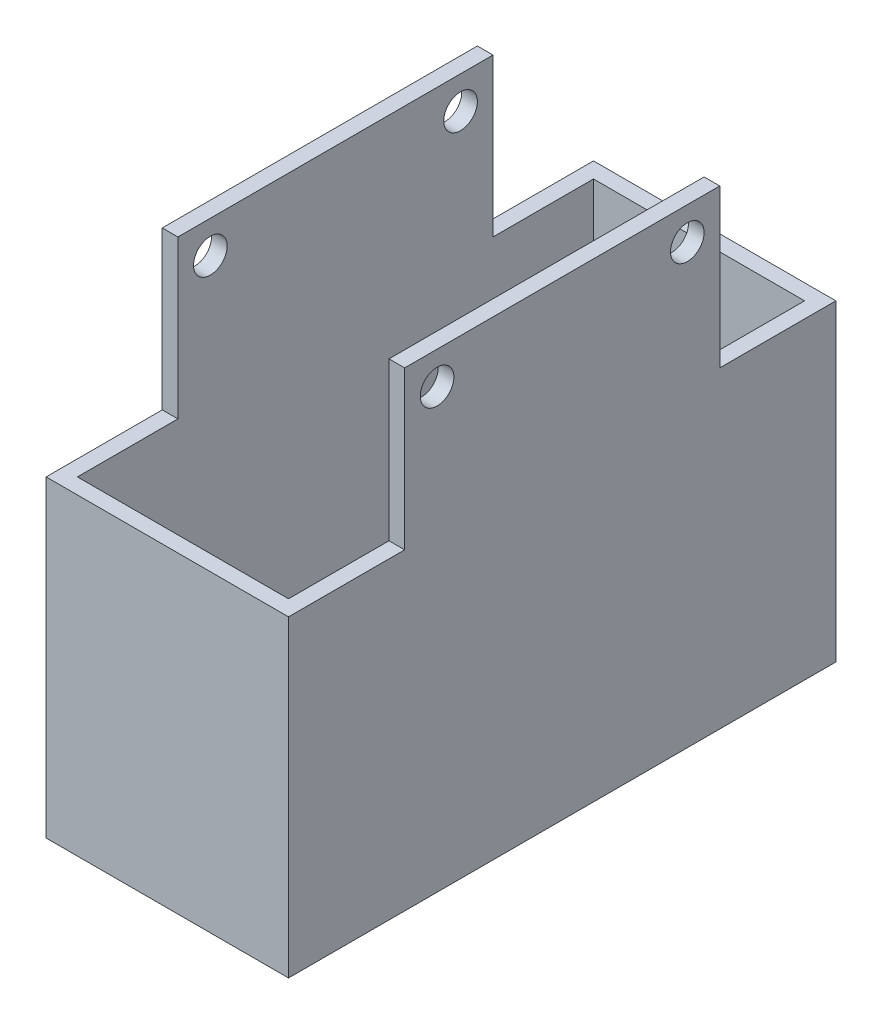
ISO-10303-21;
HEADER;
FILE_DESCRIPTION(('STEP AP214'),'2;1');
FILE_NAME('part.step','',(''),(''),'','','');
FILE_SCHEMA(('AUTOMOTIVE_DESIGN { 1 0 10303 214 1 1 1 1 }'));
ENDSEC;
DATA;
#1=APPLICATION_CONTEXT('core data for automotive mechanical design processes');
#2=APPLICATION_PROTOCOL_DEFINITION('international standard','automotive_design',2000,#1);
#3=PRODUCT_CONTEXT('',#1,'mechanical');
#4=PRODUCT('Part','Part','',(#3));
#5=PRODUCT_RELATED_PRODUCT_CATEGORY('part','',(#4));
#6=PRODUCT_DEFINITION_FORMATION('','',#4);
#7=PRODUCT_DEFINITION_CONTEXT('part definition',#1,'design');
#8=PRODUCT_DEFINITION('design','',#6,#7);
#9=PRODUCT_DEFINITION_SHAPE('','',#8);
#10=(LENGTH_UNIT() NAMED_UNIT(*) SI_UNIT(.MILLI.,.METRE.));
#11=(NAMED_UNIT(*) PLANE_ANGLE_UNIT() SI_UNIT($,.RADIAN.));
#12=(NAMED_UNIT(*) SI_UNIT($,.STERADIAN.) SOLID_ANGLE_UNIT());
#13=UNCERTAINTY_MEASURE_WITH_UNIT(LENGTH_MEASURE(1.E-05),#10,'distance_accuracy_value','');
#14=(GEOMETRIC_REPRESENTATION_CONTEXT(3) GLOBAL_UNCERTAINTY_ASSIGNED_CONTEXT((#13)) GLOBAL_UNIT_ASSIGNED_CONTEXT((#10,
#11,#12)) REPRESENTATION_CONTEXT('',''));
#15=CARTESIAN_POINT('',(0.,0.,0.));
#16=DIRECTION('',(0.,0.,1.));
#17=DIRECTION('',(1.,0.,0.));
#18=AXIS2_PLACEMENT_3D('',#15,#16,#17);
#19=CARTESIAN_POINT('',(-13.5,40.,33.));
#20=DIRECTION('',(1.,0.,0.));
#21=DIRECTION('',(0.,0.,-1.));
#22=AXIS2_PLACEMENT_3D('',#19,#20,#21);
#23=PLANE('',#22);
#24=CARTESIAN_POINT('',(-13.5,56.,-16.));
#25=DIRECTION('',(-1.,0.,0.));
#26=DIRECTION('',(0.,0.,1.));
#27=AXIS2_PLACEMENT_3D('',#24,#25,#26);
#28=CIRCLE('',#27,2.15);
#29=CARTESIAN_POINT('',(-13.5,56.,-13.85));
#30=VERTEX_POINT('',#29);
#31=EDGE_CURVE('E301',#30,#30,#28,.F.);
#32=ORIENTED_EDGE('',*,*,#31,.F.);
#33=EDGE_LOOP('',(#32));
#34=FACE_BOUND('',#33,.T.);
#35=CARTESIAN_POINT('',(-13.5,56.,16.));
#36=DIRECTION('',(-1.,0.,0.));
#37=DIRECTION('',(0.,0.,1.));
#38=AXIS2_PLACEMENT_3D('',#35,#36,#37);
#39=CIRCLE('',#38,2.15);
#40=CARTESIAN_POINT('',(-13.5,56.,18.15));
#41=VERTEX_POINT('',#40);
#42=EDGE_CURVE('E282',#41,#41,#39,.F.);
#43=ORIENTED_EDGE('',*,*,#42,.F.);
#44=EDGE_LOOP('',(#43));
#45=FACE_BOUND('',#44,.T.);
#46=DIRECTION('',(0.,-1.,0.));
#47=VECTOR('',#46,1.);
#48=CARTESIAN_POINT('',(-13.5,40.,33.));
#49=LINE('',#48,#47);
#50=CARTESIAN_POINT('',(-13.5,40.,33.));
#51=VERTEX_POINT('',#50);
#52=CARTESIAN_POINT('',(-13.5,3.,33.));
#53=VERTEX_POINT('',#52);
#54=EDGE_CURVE('E160',#51,#53,#49,.T.);
#55=ORIENTED_EDGE('',*,*,#54,.T.);
#56=DIRECTION('',(0.,0.,-1.));
#57=VECTOR('',#56,1.);
#58=CARTESIAN_POINT('',(-13.5,3.,33.));
#59=LINE('',#58,#57);
#60=CARTESIAN_POINT('',(-13.5,3.,-33.));
#61=VERTEX_POINT('',#60);
#62=EDGE_CURVE('E147',#53,#61,#59,.T.);
#63=ORIENTED_EDGE('',*,*,#62,.T.);
#64=DIRECTION('',(0.,-1.,0.));
#65=VECTOR('',#64,1.);
#66=CARTESIAN_POINT('',(-13.5,40.,-33.));
#67=LINE('',#66,#65);
#68=CARTESIAN_POINT('',(-13.5,40.,-33.));
#69=VERTEX_POINT('',#68);
#70=EDGE_CURVE('E157',#69,#61,#67,.T.);
#71=ORIENTED_EDGE('',*,*,#70,.F.);
#72=DIRECTION('',(0.,0.,1.));
#73=VECTOR('',#72,1.);
#74=CARTESIAN_POINT('',(-13.5,40.,33.));
#75=LINE('',#74,#73);
#76=CARTESIAN_POINT('',(-13.5,40.,-20.15));
#77=VERTEX_POINT('',#76);
#78=EDGE_CURVE('E226',#69,#77,#75,.T.);
#79=ORIENTED_EDGE('',*,*,#78,.T.);
#80=DIRECTION('',(0.,1.,0.));
#81=VECTOR('',#80,1.);
#82=CARTESIAN_POINT('',(-13.5,20.15,-20.15));
#83=LINE('',#82,#81);
#84=CARTESIAN_POINT('',(-13.5,60.15,-20.15));
#85=VERTEX_POINT('',#84);
#86=EDGE_CURVE('E250',#77,#85,#83,.T.);
#87=ORIENTED_EDGE('',*,*,#86,.T.);
#88=DIRECTION('',(0.,0.,1.));
#89=VECTOR('',#88,1.);
#90=CARTESIAN_POINT('',(-13.5,60.15,-20.15));
#91=LINE('',#90,#89);
#92=CARTESIAN_POINT('',(-13.5,60.15,20.15));
#93=VERTEX_POINT('',#92);
#94=EDGE_CURVE('E161',#85,#93,#91,.T.);
#95=ORIENTED_EDGE('',*,*,#94,.T.);
#96=DIRECTION('',(0.,1.,0.));
#97=VECTOR('',#96,1.);
#98=CARTESIAN_POINT('',(-13.5,20.15,20.15));
#99=LINE('',#98,#97);
#100=CARTESIAN_POINT('',(-13.5,40.,20.15));
#101=VERTEX_POINT('',#100);
#102=EDGE_CURVE('E309',#101,#93,#99,.T.);
#103=ORIENTED_EDGE('',*,*,#102,.F.);
#104=EDGE_CURVE('E224',#101,#51,#75,.T.);
#105=ORIENTED_EDGE('',*,*,#104,.T.);
#106=EDGE_LOOP('',(#55,#63,#71,#79,#87,#95,#103,#105));
#107=FACE_BOUND('',#106,.T.);
#108=ADVANCED_FACE('F36',(#34,#45,#107),#23,.T.);
#109=CARTESIAN_POINT('',(13.5,40.,33.));
#110=DIRECTION('',(0.,0.,-1.));
#111=DIRECTION('',(-1.,0.,0.));
#112=AXIS2_PLACEMENT_3D('',#109,#110,#111);
#113=PLANE('',#112);
#114=DIRECTION('',(0.,-1.,0.));
#115=VECTOR('',#114,1.);
#116=CARTESIAN_POINT('',(13.5,40.,33.));
#117=LINE('',#116,#115);
#118=CARTESIAN_POINT('',(13.5,40.,33.));
#119=VERTEX_POINT('',#118);
#120=CARTESIAN_POINT('',(13.5,3.,33.));
#121=VERTEX_POINT('',#120);
#122=EDGE_CURVE('E169',#119,#121,#117,.T.);
#123=ORIENTED_EDGE('',*,*,#122,.T.);
#124=DIRECTION('',(-1.,0.,0.));
#125=VECTOR('',#124,1.);
#126=CARTESIAN_POINT('',(13.5,3.,33.));
#127=LINE('',#126,#125);
#128=EDGE_CURVE('E162',#121,#53,#127,.T.);
#129=ORIENTED_EDGE('',*,*,#128,.T.);
#130=ORIENTED_EDGE('',*,*,#54,.F.);
#131=DIRECTION('',(1.,0.,0.));
#132=VECTOR('',#131,1.);
#133=CARTESIAN_POINT('',(13.5,40.,33.));
#134=LINE('',#133,#132);
#135=EDGE_CURVE('E242',#51,#119,#134,.T.);
#136=ORIENTED_EDGE('',*,*,#135,.T.);
#137=EDGE_LOOP('',(#123,#129,#130,#136));
#138=FACE_BOUND('',#137,.T.);
#139=ADVANCED_FACE('F316',(#138),#113,.T.);
#140=CARTESIAN_POINT('',(13.5,40.,33.));
#141=DIRECTION('',(-1.,0.,0.));
#142=DIRECTION('',(0.,0.,1.));
#143=AXIS2_PLACEMENT_3D('',#140,#141,#142);
#144=PLANE('',#143);
#145=CARTESIAN_POINT('',(13.5,56.,-16.));
#146=DIRECTION('',(1.,0.,0.));
#147=DIRECTION('',(0.,0.,-1.));
#148=AXIS2_PLACEMENT_3D('',#145,#146,#147);
#149=CIRCLE('',#148,2.15);
#150=CARTESIAN_POINT('',(13.5,56.,-18.15));
#151=VERTEX_POINT('',#150);
#152=EDGE_CURVE('E253',#151,#151,#149,.F.);
#153=ORIENTED_EDGE('',*,*,#152,.F.);
#154=EDGE_LOOP('',(#153));
#155=FACE_BOUND('',#154,.T.);
#156=CARTESIAN_POINT('',(13.5,56.,16.));
#157=DIRECTION('',(1.,0.,0.));
#158=DIRECTION('',(0.,0.,-1.));
#159=AXIS2_PLACEMENT_3D('',#156,#157,#158);
#160=CIRCLE('',#159,2.15);
#161=CARTESIAN_POINT('',(13.5,56.,13.85));
#162=VERTEX_POINT('',#161);
#163=EDGE_CURVE('E304',#162,#162,#160,.F.);
#164=ORIENTED_EDGE('',*,*,#163,.F.);
#165=EDGE_LOOP('',(#164));
#166=FACE_BOUND('',#165,.T.);
#167=DIRECTION('',(0.,-1.,0.));
#168=VECTOR('',#167,1.);
#169=CARTESIAN_POINT('',(13.5,40.,-33.));
#170=LINE('',#169,#168);
#171=CARTESIAN_POINT('',(13.5,40.,-33.));
#172=VERTEX_POINT('',#171);
#173=CARTESIAN_POINT('',(13.5,3.,-33.));
#174=VERTEX_POINT('',#173);
#175=EDGE_CURVE('E167',#172,#174,#170,.T.);
#176=ORIENTED_EDGE('',*,*,#175,.T.);
#177=DIRECTION('',(0.,0.,1.));
#178=VECTOR('',#177,1.);
#179=CARTESIAN_POINT('',(13.5,3.,33.));
#180=LINE('',#179,#178);
#181=EDGE_CURVE('E51',#174,#121,#180,.T.);
#182=ORIENTED_EDGE('',*,*,#181,.T.);
#183=ORIENTED_EDGE('',*,*,#122,.F.);
#184=DIRECTION('',(0.,0.,-1.));
#185=VECTOR('',#184,1.);
#186=CARTESIAN_POINT('',(13.5,40.,33.));
#187=LINE('',#186,#185);
#188=CARTESIAN_POINT('',(13.5,40.,20.15));
#189=VERTEX_POINT('',#188);
#190=EDGE_CURVE('E171',#119,#189,#187,.T.);
#191=ORIENTED_EDGE('',*,*,#190,.T.);
#192=DIRECTION('',(0.,1.,0.));
#193=VECTOR('',#192,1.);
#194=CARTESIAN_POINT('',(13.5,20.15,20.15));
#195=LINE('',#194,#193);
#196=CARTESIAN_POINT('',(13.5,60.15,20.15));
#197=VERTEX_POINT('',#196);
#198=EDGE_CURVE('E58',#189,#197,#195,.T.);
#199=ORIENTED_EDGE('',*,*,#198,.T.);
#200=DIRECTION('',(0.,0.,-1.));
#201=VECTOR('',#200,1.);
#202=CARTESIAN_POINT('',(13.5,60.15,-20.15));
#203=LINE('',#202,#201);
#204=CARTESIAN_POINT('',(13.5,60.15,-20.15));
#205=VERTEX_POINT('',#204);
#206=EDGE_CURVE('E261',#197,#205,#203,.T.);
#207=ORIENTED_EDGE('',*,*,#206,.T.);
#208=DIRECTION('',(0.,1.,0.));
#209=VECTOR('',#208,1.);
#210=CARTESIAN_POINT('',(13.5,20.15,-20.15));
#211=LINE('',#210,#209);
#212=CARTESIAN_POINT('',(13.5,40.,-20.15));
#213=VERTEX_POINT('',#212);
#214=EDGE_CURVE('E248',#213,#205,#211,.T.);
#215=ORIENTED_EDGE('',*,*,#214,.F.);
#216=EDGE_CURVE('E243',#213,#172,#187,.T.);
#217=ORIENTED_EDGE('',*,*,#216,.T.);
#218=EDGE_LOOP('',(#176,#182,#183,#191,#199,#207,#215,#217));
#219=FACE_BOUND('',#218,.T.);
#220=ADVANCED_FACE('F246',(#155,#166,#219),#144,.T.);
#221=CARTESIAN_POINT('',(13.5,40.,-33.));
#222=DIRECTION('',(0.,0.,1.));
#223=DIRECTION('',(1.,0.,0.));
#224=AXIS2_PLACEMENT_3D('',#221,#222,#223);
#225=PLANE('',#224);
#226=ORIENTED_EDGE('',*,*,#70,.T.);
#227=DIRECTION('',(1.,0.,0.));
#228=VECTOR('',#227,1.);
#229=CARTESIAN_POINT('',(13.5,3.,-33.));
#230=LINE('',#229,#228);
#231=EDGE_CURVE('E11',#61,#174,#230,.T.);
#232=ORIENTED_EDGE('',*,*,#231,.T.);
#233=ORIENTED_EDGE('',*,*,#175,.F.);
#234=DIRECTION('',(-1.,0.,0.));
#235=VECTOR('',#234,1.);
#236=CARTESIAN_POINT('',(13.5,40.,-33.));
#237=LINE('',#236,#235);
#238=EDGE_CURVE('E166',#172,#69,#237,.T.);
#239=ORIENTED_EDGE('',*,*,#238,.T.);
#240=EDGE_LOOP('',(#226,#232,#233,#239));
#241=FACE_BOUND('',#240,.T.);
#242=ADVANCED_FACE('F164',(#241),#225,.T.);
#243=CARTESIAN_POINT('',(-15.5,0.,-20.15));
#244=DIRECTION('',(0.,0.,1.));
#245=DIRECTION('',(1.,0.,0.));
#246=AXIS2_PLACEMENT_3D('',#243,#244,#245);
#247=PLANE('',#246);
#248=DIRECTION('',(1.,0.,0.));
#249=VECTOR('',#248,1.);
#250=CARTESIAN_POINT('',(-15.5,60.15,-20.15));
#251=LINE('',#250,#249);
#252=CARTESIAN_POINT('',(-15.5,60.15,-20.15));
#253=VERTEX_POINT('',#252);
#254=EDGE_CURVE('E238',#253,#85,#251,.T.);
#255=ORIENTED_EDGE('',*,*,#254,.T.);
#256=ORIENTED_EDGE('',*,*,#86,.F.);
#257=DIRECTION('',(1.,0.,0.));
#258=VECTOR('',#257,1.);
#259=CARTESIAN_POINT('',(-15.5,40.,-20.15));
#260=LINE('',#259,#258);
#261=CARTESIAN_POINT('',(-15.5,40.,-20.15));
#262=VERTEX_POINT('',#261);
#263=EDGE_CURVE('E215',#262,#77,#260,.T.);
#264=ORIENTED_EDGE('',*,*,#263,.F.);
#265=DIRECTION('',(0.,-1.,0.));
#266=VECTOR('',#265,1.);
#267=CARTESIAN_POINT('',(-15.5,0.,-20.15));
#268=LINE('',#267,#266);
#269=EDGE_CURVE('E264',#253,#262,#268,.T.);
#270=ORIENTED_EDGE('',*,*,#269,.F.);
#271=EDGE_LOOP('',(#255,#256,#264,#270));
#272=FACE_BOUND('',#271,.T.);
#273=ADVANCED_FACE('F263',(#272),#247,.F.);
#274=CARTESIAN_POINT('',(-15.5,0.,20.15));
#275=DIRECTION('',(0.,0.,-1.));
#276=DIRECTION('',(-1.,0.,0.));
#277=AXIS2_PLACEMENT_3D('',#274,#275,#276);
#278=PLANE('',#277);
#279=DIRECTION('',(1.,0.,0.));
#280=VECTOR('',#279,1.);
#281=CARTESIAN_POINT('',(-15.5,40.,20.15));
#282=LINE('',#281,#280);
#283=CARTESIAN_POINT('',(-15.5,40.,20.15));
#284=VERTEX_POINT('',#283);
#285=EDGE_CURVE('E221',#284,#101,#282,.T.);
#286=ORIENTED_EDGE('',*,*,#285,.T.);
#287=ORIENTED_EDGE('',*,*,#102,.T.);
#288=DIRECTION('',(1.,0.,0.));
#289=VECTOR('',#288,1.);
#290=CARTESIAN_POINT('',(-15.5,60.15,20.15));
#291=LINE('',#290,#289);
#292=CARTESIAN_POINT('',(-15.5,60.15,20.15));
#293=VERTEX_POINT('',#292);
#294=EDGE_CURVE('E229',#293,#93,#291,.T.);
#295=ORIENTED_EDGE('',*,*,#294,.F.);
#296=DIRECTION('',(0.,1.,0.));
#297=VECTOR('',#296,1.);
#298=CARTESIAN_POINT('',(-15.5,0.,20.15));
#299=LINE('',#298,#297);
#300=EDGE_CURVE('E270',#284,#293,#299,.T.);
#301=ORIENTED_EDGE('',*,*,#300,.F.);
#302=EDGE_LOOP('',(#286,#287,#295,#301));
#303=FACE_BOUND('',#302,.T.);
#304=ADVANCED_FACE('F341',(#303),#278,.F.);
#305=CARTESIAN_POINT('',(-15.5,56.,16.));
#306=DIRECTION('',(1.,0.,0.));
#307=DIRECTION('',(0.,0.,-1.));
#308=AXIS2_PLACEMENT_3D('',#305,#306,#307);
#309=CYLINDRICAL_SURFACE('',#308,2.15);
#310=ORIENTED_EDGE('',*,*,#42,.T.);
#311=EDGE_LOOP('',(#310));
#312=FACE_BOUND('',#311,.T.);
#313=CARTESIAN_POINT('',(-15.5,56.,16.));
#314=DIRECTION('',(1.,0.,0.));
#315=DIRECTION('',(0.,0.,-1.));
#316=AXIS2_PLACEMENT_3D('',#313,#314,#315);
#317=CIRCLE('',#316,2.15);
#318=CARTESIAN_POINT('',(-15.5,56.,13.85));
#319=VERTEX_POINT('',#318);
#320=EDGE_CURVE('E268',#319,#319,#317,.T.);
#321=ORIENTED_EDGE('',*,*,#320,.F.);
#322=EDGE_LOOP('',(#321));
#323=FACE_BOUND('',#322,.T.);
#324=ADVANCED_FACE('F380',(#312,#323),#309,.F.);
#325=CARTESIAN_POINT('',(-15.5,56.,-16.));
#326=DIRECTION('',(1.,0.,0.));
#327=DIRECTION('',(0.,0.,-1.));
#328=AXIS2_PLACEMENT_3D('',#325,#326,#327);
#329=CYLINDRICAL_SURFACE('',#328,2.15);
#330=ORIENTED_EDGE('',*,*,#31,.T.);
#331=EDGE_LOOP('',(#330));
#332=FACE_BOUND('',#331,.T.);
#333=CARTESIAN_POINT('',(-15.5,56.,-16.));
#334=DIRECTION('',(1.,0.,0.));
#335=DIRECTION('',(0.,0.,-1.));
#336=AXIS2_PLACEMENT_3D('',#333,#334,#335);
#337=CIRCLE('',#336,2.15);
#338=CARTESIAN_POINT('',(-15.5,56.,-18.15));
#339=VERTEX_POINT('',#338);
#340=EDGE_CURVE('E273',#339,#339,#337,.T.);
#341=ORIENTED_EDGE('',*,*,#340,.F.);
#342=EDGE_LOOP('',(#341));
#343=FACE_BOUND('',#342,.T.);
#344=ADVANCED_FACE('F384',(#332,#343),#329,.F.);
#345=CARTESIAN_POINT('',(-15.5,60.15,0.));
#346=DIRECTION('',(0.,-1.,0.));
#347=DIRECTION('',(0.,0.,-1.));
#348=AXIS2_PLACEMENT_3D('',#345,#346,#347);
#349=PLANE('',#348);
#350=ORIENTED_EDGE('',*,*,#294,.T.);
#351=ORIENTED_EDGE('',*,*,#94,.F.);
#352=ORIENTED_EDGE('',*,*,#254,.F.);
#353=DIRECTION('',(0.,0.,-1.));
#354=VECTOR('',#353,1.);
#355=CARTESIAN_POINT('',(-15.5,60.15,0.));
#356=LINE('',#355,#354);
#357=EDGE_CURVE('E267',#293,#253,#356,.T.);
#358=ORIENTED_EDGE('',*,*,#357,.F.);
#359=EDGE_LOOP('',(#350,#351,#352,#358));
#360=FACE_BOUND('',#359,.T.);
#361=ADVANCED_FACE('F257',(#360),#349,.F.);
#362=CARTESIAN_POINT('',(0.,40.,0.));
#363=DIRECTION('',(0.,1.,0.));
#364=DIRECTION('',(0.,0.,1.));
#365=AXIS2_PLACEMENT_3D('',#362,#363,#364);
#366=PLANE('',#365);
#367=DIRECTION('',(0.,0.,1.));
#368=VECTOR('',#367,1.);
#369=CARTESIAN_POINT('',(-15.5,40.,35.));
#370=LINE('',#369,#368);
#371=CARTESIAN_POINT('',(-15.5,40.,-35.));
#372=VERTEX_POINT('',#371);
#373=EDGE_CURVE('E179',#372,#262,#370,.T.);
#374=ORIENTED_EDGE('',*,*,#373,.T.);
#375=ORIENTED_EDGE('',*,*,#263,.T.);
#376=ORIENTED_EDGE('',*,*,#78,.F.);
#377=ORIENTED_EDGE('',*,*,#238,.F.);
#378=ORIENTED_EDGE('',*,*,#216,.F.);
#379=CARTESIAN_POINT('',(15.5,40.,-20.15));
#380=VERTEX_POINT('',#379);
#381=EDGE_CURVE('E208',#213,#380,#260,.T.);
#382=ORIENTED_EDGE('',*,*,#381,.T.);
#383=DIRECTION('',(0.,0.,-1.));
#384=VECTOR('',#383,1.);
#385=CARTESIAN_POINT('',(15.5,40.,35.));
#386=LINE('',#385,#384);
#387=CARTESIAN_POINT('',(15.5,40.,-35.));
#388=VERTEX_POINT('',#387);
#389=EDGE_CURVE('E185',#380,#388,#386,.T.);
#390=ORIENTED_EDGE('',*,*,#389,.T.);
#391=DIRECTION('',(-1.,0.,0.));
#392=VECTOR('',#391,1.);
#393=CARTESIAN_POINT('',(15.5,40.,-35.));
#394=LINE('',#393,#392);
#395=EDGE_CURVE('E189',#388,#372,#394,.T.);
#396=ORIENTED_EDGE('',*,*,#395,.T.);
#397=EDGE_LOOP('',(#374,#375,#376,#377,#378,#382,#390,#396));
#398=FACE_BOUND('',#397,.T.);
#399=ADVANCED_FACE('F249',(#398),#366,.T.);
#400=ORIENTED_EDGE('',*,*,#285,.F.);
#401=CARTESIAN_POINT('',(-15.5,40.,35.));
#402=VERTEX_POINT('',#401);
#403=EDGE_CURVE('E183',#284,#402,#370,.T.);
#404=ORIENTED_EDGE('',*,*,#403,.T.);
#405=DIRECTION('',(1.,0.,0.));
#406=VECTOR('',#405,1.);
#407=CARTESIAN_POINT('',(15.5,40.,35.));
#408=LINE('',#407,#406);
#409=CARTESIAN_POINT('',(15.5,40.,35.));
#410=VERTEX_POINT('',#409);
#411=EDGE_CURVE('E182',#402,#410,#408,.T.);
#412=ORIENTED_EDGE('',*,*,#411,.T.);
#413=CARTESIAN_POINT('',(15.5,40.,20.15));
#414=VERTEX_POINT('',#413);
#415=EDGE_CURVE('E186',#410,#414,#386,.T.);
#416=ORIENTED_EDGE('',*,*,#415,.T.);
#417=EDGE_CURVE('E44',#189,#414,#282,.T.);
#418=ORIENTED_EDGE('',*,*,#417,.F.);
#419=ORIENTED_EDGE('',*,*,#190,.F.);
#420=ORIENTED_EDGE('',*,*,#135,.F.);
#421=ORIENTED_EDGE('',*,*,#104,.F.);
#422=EDGE_LOOP('',(#400,#404,#412,#416,#418,#419,#420,#421));
#423=FACE_BOUND('',#422,.T.);
#424=ADVANCED_FACE('F319',(#423),#366,.T.);
#425=CARTESIAN_POINT('',(0.,0.,0.));
#426=DIRECTION('',(0.,1.,0.));
#427=DIRECTION('',(0.,0.,1.));
#428=AXIS2_PLACEMENT_3D('',#425,#426,#427);
#429=PLANE('',#428);
#430=DIRECTION('',(0.,0.,1.));
#431=VECTOR('',#430,1.);
#432=CARTESIAN_POINT('',(-15.5,0.,35.));
#433=LINE('',#432,#431);
#434=CARTESIAN_POINT('',(-15.5,0.,-35.));
#435=VERTEX_POINT('',#434);
#436=CARTESIAN_POINT('',(-15.5,0.,35.));
#437=VERTEX_POINT('',#436);
#438=EDGE_CURVE('E178',#435,#437,#433,.T.);
#439=ORIENTED_EDGE('',*,*,#438,.F.);
#440=DIRECTION('',(-1.,0.,0.));
#441=VECTOR('',#440,1.);
#442=CARTESIAN_POINT('',(15.5,0.,-35.));
#443=LINE('',#442,#441);
#444=CARTESIAN_POINT('',(15.5,0.,-35.));
#445=VERTEX_POINT('',#444);
#446=EDGE_CURVE('E200',#445,#435,#443,.T.);
#447=ORIENTED_EDGE('',*,*,#446,.F.);
#448=DIRECTION('',(0.,0.,-1.));
#449=VECTOR('',#448,1.);
#450=CARTESIAN_POINT('',(15.5,0.,35.));
#451=LINE('',#450,#449);
#452=CARTESIAN_POINT('',(15.5,0.,35.));
#453=VERTEX_POINT('',#452);
#454=EDGE_CURVE('E197',#453,#445,#451,.T.);
#455=ORIENTED_EDGE('',*,*,#454,.F.);
#456=DIRECTION('',(1.,0.,0.));
#457=VECTOR('',#456,1.);
#458=CARTESIAN_POINT('',(15.5,0.,35.));
#459=LINE('',#458,#457);
#460=EDGE_CURVE('E194',#437,#453,#459,.T.);
#461=ORIENTED_EDGE('',*,*,#460,.F.);
#462=EDGE_LOOP('',(#439,#447,#455,#461));
#463=FACE_BOUND('',#462,.T.);
#464=ADVANCED_FACE('F360',(#463),#429,.F.);
#465=CARTESIAN_POINT('',(-15.5,40.,35.));
#466=DIRECTION('',(1.,0.,0.));
#467=DIRECTION('',(0.,0.,-1.));
#468=AXIS2_PLACEMENT_3D('',#465,#466,#467);
#469=PLANE('',#468);
#470=ORIENTED_EDGE('',*,*,#438,.T.);
#471=DIRECTION('',(0.,-1.,0.));
#472=VECTOR('',#471,1.);
#473=CARTESIAN_POINT('',(-15.5,40.,35.));
#474=LINE('',#473,#472);
#475=EDGE_CURVE('E207',#402,#437,#474,.T.);
#476=ORIENTED_EDGE('',*,*,#475,.F.);
#477=ORIENTED_EDGE('',*,*,#403,.F.);
#478=ORIENTED_EDGE('',*,*,#300,.T.);
#479=ORIENTED_EDGE('',*,*,#357,.T.);
#480=ORIENTED_EDGE('',*,*,#269,.T.);
#481=ORIENTED_EDGE('',*,*,#373,.F.);
#482=DIRECTION('',(0.,-1.,0.));
#483=VECTOR('',#482,1.);
#484=CARTESIAN_POINT('',(-15.5,40.,-35.));
#485=LINE('',#484,#483);
#486=EDGE_CURVE('E191',#372,#435,#485,.T.);
#487=ORIENTED_EDGE('',*,*,#486,.T.);
#488=EDGE_LOOP('',(#470,#476,#477,#478,#479,#480,#481,#487));
#489=FACE_BOUND('',#488,.T.);
#490=ORIENTED_EDGE('',*,*,#320,.T.);
#491=EDGE_LOOP('',(#490));
#492=FACE_BOUND('',#491,.T.);
#493=ORIENTED_EDGE('',*,*,#340,.T.);
#494=EDGE_LOOP('',(#493));
#495=FACE_BOUND('',#494,.T.);
#496=ADVANCED_FACE('F38',(#489,#492,#495),#469,.F.);
#497=CARTESIAN_POINT('',(15.5,40.,35.));
#498=DIRECTION('',(0.,0.,-1.));
#499=DIRECTION('',(-1.,0.,0.));
#500=AXIS2_PLACEMENT_3D('',#497,#498,#499);
#501=PLANE('',#500);
#502=ORIENTED_EDGE('',*,*,#460,.T.);
#503=DIRECTION('',(0.,-1.,0.));
#504=VECTOR('',#503,1.);
#505=CARTESIAN_POINT('',(15.5,40.,35.));
#506=LINE('',#505,#504);
#507=EDGE_CURVE('E206',#410,#453,#506,.T.);
#508=ORIENTED_EDGE('',*,*,#507,.F.);
#509=ORIENTED_EDGE('',*,*,#411,.F.);
#510=ORIENTED_EDGE('',*,*,#475,.T.);
#511=EDGE_LOOP('',(#502,#508,#509,#510));
#512=FACE_BOUND('',#511,.T.);
#513=ADVANCED_FACE('F365',(#512),#501,.F.);
#514=CARTESIAN_POINT('',(15.5,40.,35.));
#515=DIRECTION('',(-1.,0.,0.));
#516=DIRECTION('',(0.,0.,1.));
#517=AXIS2_PLACEMENT_3D('',#514,#515,#516);
#518=PLANE('',#517);
#519=ORIENTED_EDGE('',*,*,#454,.T.);
#520=DIRECTION('',(0.,-1.,0.));
#521=VECTOR('',#520,1.);
#522=CARTESIAN_POINT('',(15.5,40.,-35.));
#523=LINE('',#522,#521);
#524=EDGE_CURVE('E204',#388,#445,#523,.T.);
#525=ORIENTED_EDGE('',*,*,#524,.F.);
#526=ORIENTED_EDGE('',*,*,#389,.F.);
#527=DIRECTION('',(0.,-1.,0.));
#528=VECTOR('',#527,1.);
#529=CARTESIAN_POINT('',(15.5,0.,-20.15));
#530=LINE('',#529,#528);
#531=CARTESIAN_POINT('',(15.5,60.15,-20.15));
#532=VERTEX_POINT('',#531);
#533=EDGE_CURVE('E285',#532,#380,#530,.T.);
#534=ORIENTED_EDGE('',*,*,#533,.F.);
#535=DIRECTION('',(0.,0.,-1.));
#536=VECTOR('',#535,1.);
#537=CARTESIAN_POINT('',(15.5,60.15,0.));
#538=LINE('',#537,#536);
#539=CARTESIAN_POINT('',(15.5,60.15,20.15));
#540=VERTEX_POINT('',#539);
#541=EDGE_CURVE('E287',#540,#532,#538,.T.);
#542=ORIENTED_EDGE('',*,*,#541,.F.);
#543=DIRECTION('',(0.,1.,0.));
#544=VECTOR('',#543,1.);
#545=CARTESIAN_POINT('',(15.5,0.,20.15));
#546=LINE('',#545,#544);
#547=EDGE_CURVE('E289',#414,#540,#546,.T.);
#548=ORIENTED_EDGE('',*,*,#547,.F.);
#549=ORIENTED_EDGE('',*,*,#415,.F.);
#550=ORIENTED_EDGE('',*,*,#507,.T.);
#551=EDGE_LOOP('',(#519,#525,#526,#534,#542,#548,#549,#550));
#552=FACE_BOUND('',#551,.T.);
#553=CARTESIAN_POINT('',(15.5,56.,16.));
#554=DIRECTION('',(1.,0.,0.));
#555=DIRECTION('',(0.,0.,-1.));
#556=AXIS2_PLACEMENT_3D('',#553,#554,#555);
#557=CIRCLE('',#556,2.15);
#558=CARTESIAN_POINT('',(15.5,56.,13.85));
#559=VERTEX_POINT('',#558);
#560=EDGE_CURVE('E281',#559,#559,#557,.T.);
#561=ORIENTED_EDGE('',*,*,#560,.F.);
#562=EDGE_LOOP('',(#561));
#563=FACE_BOUND('',#562,.T.);
#564=CARTESIAN_POINT('',(15.5,56.,-16.));
#565=DIRECTION('',(1.,0.,0.));
#566=DIRECTION('',(0.,0.,-1.));
#567=AXIS2_PLACEMENT_3D('',#564,#565,#566);
#568=CIRCLE('',#567,2.15);
#569=CARTESIAN_POINT('',(15.5,56.,-18.15));
#570=VERTEX_POINT('',#569);
#571=EDGE_CURVE('E278',#570,#570,#568,.T.);
#572=ORIENTED_EDGE('',*,*,#571,.F.);
#573=EDGE_LOOP('',(#572));
#574=FACE_BOUND('',#573,.T.);
#575=ADVANCED_FACE('F324',(#552,#563,#574),#518,.F.);
#576=CARTESIAN_POINT('',(15.5,40.,-35.));
#577=DIRECTION('',(0.,0.,1.));
#578=DIRECTION('',(1.,0.,0.));
#579=AXIS2_PLACEMENT_3D('',#576,#577,#578);
#580=PLANE('',#579);
#581=ORIENTED_EDGE('',*,*,#446,.T.);
#582=ORIENTED_EDGE('',*,*,#486,.F.);
#583=ORIENTED_EDGE('',*,*,#395,.F.);
#584=ORIENTED_EDGE('',*,*,#524,.T.);
#585=EDGE_LOOP('',(#581,#582,#583,#584));
#586=FACE_BOUND('',#585,.T.);
#587=ADVANCED_FACE('F333',(#586),#580,.F.);
#588=ORIENTED_EDGE('',*,*,#381,.F.);
#589=ORIENTED_EDGE('',*,*,#214,.T.);
#590=EDGE_CURVE('E240',#205,#532,#251,.T.);
#591=ORIENTED_EDGE('',*,*,#590,.T.);
#592=ORIENTED_EDGE('',*,*,#533,.T.);
#593=EDGE_LOOP('',(#588,#589,#591,#592));
#594=FACE_BOUND('',#593,.T.);
#595=ADVANCED_FACE('F331',(#594),#247,.F.);
#596=EDGE_CURVE('E235',#197,#540,#291,.T.);
#597=ORIENTED_EDGE('',*,*,#596,.F.);
#598=ORIENTED_EDGE('',*,*,#198,.F.);
#599=ORIENTED_EDGE('',*,*,#417,.T.);
#600=ORIENTED_EDGE('',*,*,#547,.T.);
#601=EDGE_LOOP('',(#597,#598,#599,#600));
#602=FACE_BOUND('',#601,.T.);
#603=ADVANCED_FACE('F322',(#602),#278,.F.);
#604=ORIENTED_EDGE('',*,*,#163,.T.);
#605=EDGE_LOOP('',(#604));
#606=FACE_BOUND('',#605,.T.);
#607=ORIENTED_EDGE('',*,*,#560,.T.);
#608=EDGE_LOOP('',(#607));
#609=FACE_BOUND('',#608,.T.);
#610=ADVANCED_FACE('F339',(#606,#609),#309,.F.);
#611=ORIENTED_EDGE('',*,*,#152,.T.);
#612=EDGE_LOOP('',(#611));
#613=FACE_BOUND('',#612,.T.);
#614=ORIENTED_EDGE('',*,*,#571,.T.);
#615=EDGE_LOOP('',(#614));
#616=FACE_BOUND('',#615,.T.);
#617=ADVANCED_FACE('F388',(#613,#616),#329,.F.);
#618=ORIENTED_EDGE('',*,*,#590,.F.);
#619=ORIENTED_EDGE('',*,*,#206,.F.);
#620=ORIENTED_EDGE('',*,*,#596,.T.);
#621=ORIENTED_EDGE('',*,*,#541,.T.);
#622=EDGE_LOOP('',(#618,#619,#620,#621));
#623=FACE_BOUND('',#622,.T.);
#624=ADVANCED_FACE('F329',(#623),#349,.F.);
#625=CARTESIAN_POINT('',(0.,3.,0.));
#626=DIRECTION('',(0.,-1.,0.));
#627=DIRECTION('',(0.,0.,-1.));
#628=AXIS2_PLACEMENT_3D('',#625,#626,#627);
#629=PLANE('',#628);
#630=ORIENTED_EDGE('',*,*,#62,.F.);
#631=ORIENTED_EDGE('',*,*,#128,.F.);
#632=ORIENTED_EDGE('',*,*,#181,.F.);
#633=ORIENTED_EDGE('',*,*,#231,.F.);
#634=EDGE_LOOP('',(#630,#631,#632,#633));
#635=FACE_BOUND('',#634,.T.);
#636=ADVANCED_FACE('F146',(#635),#629,.F.);
#637=CLOSED_SHELL('',(#108,#139,#220,#242,#273,#304,#324,#344,#361,#399,#424,#464,#496,#513,
#575,#587,#595,#603,#610,#617,#624,#636));
#638=MANIFOLD_SOLID_BREP('B2',#637);
#639=ADVANCED_BREP_SHAPE_REPRESENTATION('',(#18,#638),#14);
#640=SHAPE_DEFINITION_REPRESENTATION(#9,#639);
ENDSEC;
END-ISO-10303-21;
